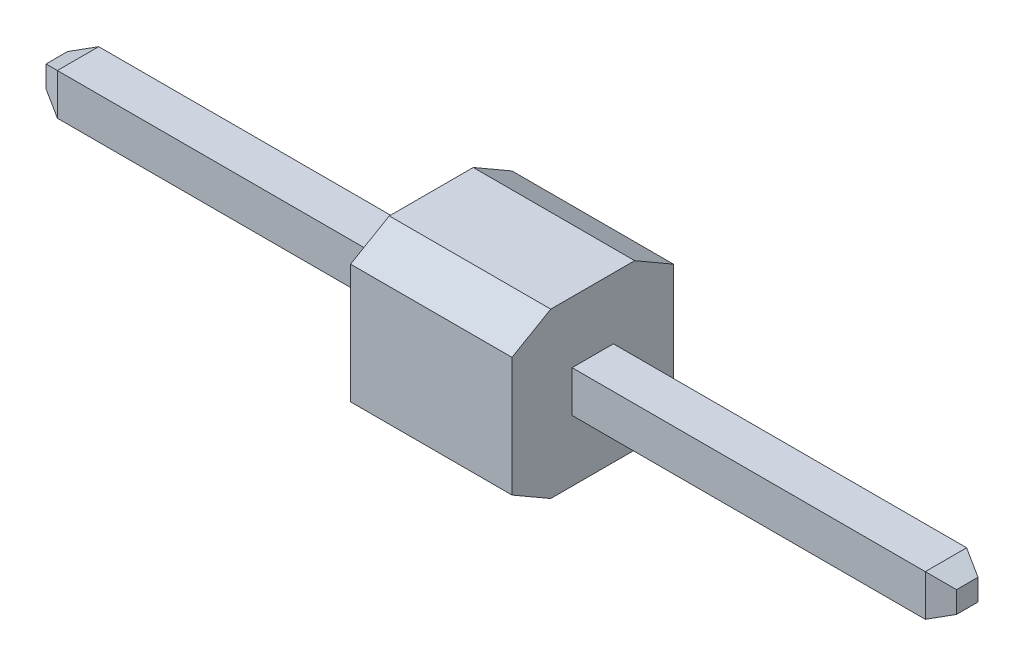
ISO-10303-21;
HEADER;
FILE_DESCRIPTION(('STEP AP214'),'2;1');
FILE_NAME('part.step','',(''),(''),'','','');
FILE_SCHEMA(('AUTOMOTIVE_DESIGN { 1 0 10303 214 1 1 1 1 }'));
ENDSEC;
DATA;
#1=APPLICATION_CONTEXT('core data for automotive mechanical design processes');
#2=APPLICATION_PROTOCOL_DEFINITION('international standard','automotive_design',2000,#1);
#3=PRODUCT_CONTEXT('',#1,'mechanical');
#4=PRODUCT('Part','Part','',(#3));
#5=PRODUCT_RELATED_PRODUCT_CATEGORY('part','',(#4));
#6=PRODUCT_DEFINITION_FORMATION('','',#4);
#7=PRODUCT_DEFINITION_CONTEXT('part definition',#1,'design');
#8=PRODUCT_DEFINITION('design','',#6,#7);
#9=PRODUCT_DEFINITION_SHAPE('','',#8);
#10=(LENGTH_UNIT() NAMED_UNIT(*) SI_UNIT(.MILLI.,.METRE.));
#11=(NAMED_UNIT(*) PLANE_ANGLE_UNIT() SI_UNIT($,.RADIAN.));
#12=(NAMED_UNIT(*) SI_UNIT($,.STERADIAN.) SOLID_ANGLE_UNIT());
#13=UNCERTAINTY_MEASURE_WITH_UNIT(LENGTH_MEASURE(1.E-05),#10,'distance_accuracy_value','');
#14=(GEOMETRIC_REPRESENTATION_CONTEXT(3) GLOBAL_UNCERTAINTY_ASSIGNED_CONTEXT((#13)) GLOBAL_UNIT_ASSIGNED_CONTEXT((#10,
#11,#12)) REPRESENTATION_CONTEXT('',''));
#15=CARTESIAN_POINT('',(0.,0.,0.));
#16=DIRECTION('',(0.,0.,1.));
#17=DIRECTION('',(1.,0.,0.));
#18=AXIS2_PLACEMENT_3D('',#15,#16,#17);
#19=CARTESIAN_POINT('',(5.42105110893747,2.85712144810304,-2.62999847646261));
#20=DIRECTION('',(1.,-9.93476518829084E-08,4.37113882867379E-08));
#21=DIRECTION('',(-9.93476589883358E-08,-1.,8.74227765734759E-08));
#22=AXIS2_PLACEMENT_3D('',#19,#20,#21);
#23=PLANE('',#22);
#24=DIRECTION('',(-1.18186632779335E-08,-0.50000007571054,-0.866025360072933));
#25=VECTOR('',#24,1.);
#26=CARTESIAN_POINT('',(5.42105091676287,1.61353174686681,-1.05999836774454));
#27=LINE('',#26,#25);
#28=CARTESIAN_POINT('',(5.42105091676287,1.61353174686681,-1.05999836774454));
#29=VERTEX_POINT('',#28);
#30=CARTESIAN_POINT('',(5.42105090857466,1.26712153290314,-1.6599983374604));
#31=VERTEX_POINT('',#30);
#32=EDGE_CURVE('E11',#29,#31,#27,.T.);
#33=ORIENTED_EDGE('',*,*,#32,.T.);
#34=DIRECTION('',(4.37113811813104E-08,-8.74227828590458E-08,-0.999999999999995));
#35=VECTOR('',#34,1.);
#36=CARTESIAN_POINT('',(5.42105090857466,1.26712153290314,-1.6599983374604));
#37=LINE('',#36,#35);
#38=CARTESIAN_POINT('',(5.42105096539945,1.26712141925352,-2.9599983374604));
#39=VERTEX_POINT('',#38);
#40=EDGE_CURVE('E304',#31,#39,#37,.T.);
#41=ORIENTED_EDGE('',*,*,#40,.T.);
#42=DIRECTION('',(8.75289963531795E-08,0.499999924289837,-0.866025447495713));
#43=VECTOR('',#42,1.);
#44=CARTESIAN_POINT('',(5.42105096539945,1.26712141925352,-2.9599983374604));
#45=LINE('',#44,#43);
#46=CARTESIAN_POINT('',(5.42105102604132,1.61353152830985,-3.55999836774454));
#47=VERTEX_POINT('',#46);
#48=EDGE_CURVE('E296',#39,#47,#45,.T.);
#49=ORIENTED_EDGE('',*,*,#48,.T.);
#50=DIRECTION('',(9.93476588436478E-08,0.999999999999991,-8.74227764822788E-08));
#51=VECTOR('',#50,1.);
#52=CARTESIAN_POINT('',(5.42105102604132,1.61353152830985,-3.55999836774454));
#53=LINE('',#52,#51);
#54=CARTESIAN_POINT('',(5.4210512095543,3.46071120527985,-3.55999852923011));
#55=VERTEX_POINT('',#54);
#56=EDGE_CURVE('E281',#47,#55,#53,.T.);
#57=ORIENTED_EDGE('',*,*,#56,.T.);
#58=DIRECTION('',(-1.18186619958731E-08,-0.500000075710537,-0.866025360072935));
#59=VECTOR('',#58,1.);
#60=CARTESIAN_POINT('',(5.42105121774251,3.80712141925352,-2.95999855951425));
#61=LINE('',#60,#59);
#62=CARTESIAN_POINT('',(5.42105121774251,3.80712141925352,-2.95999855951425));
#63=VERTEX_POINT('',#62);
#64=EDGE_CURVE('E265',#63,#55,#61,.T.);
#65=ORIENTED_EDGE('',*,*,#64,.F.);
#66=DIRECTION('',(4.37113811813104E-08,-8.74227814926175E-08,-0.999999999999995));
#67=VECTOR('',#66,1.);
#68=CARTESIAN_POINT('',(5.42105116091771,3.80712153290314,-1.65999855951425));
#69=LINE('',#68,#67);
#70=CARTESIAN_POINT('',(5.42105116091771,3.80712153290314,-1.65999855951425));
#71=VERTEX_POINT('',#70);
#72=EDGE_CURVE('E248',#71,#63,#69,.T.);
#73=ORIENTED_EDGE('',*,*,#72,.F.);
#74=DIRECTION('',(8.75289963525478E-08,0.499999924289836,-0.866025447495714));
#75=VECTOR('',#74,1.);
#76=CARTESIAN_POINT('',(5.42105110027584,3.46071142383681,-1.05999852923011));
#77=LINE('',#76,#75);
#78=CARTESIAN_POINT('',(5.42105110027584,3.46071142383681,-1.05999852923011));
#79=VERTEX_POINT('',#78);
#80=EDGE_CURVE('E242',#79,#71,#77,.T.);
#81=ORIENTED_EDGE('',*,*,#80,.F.);
#82=DIRECTION('',(9.93476588436478E-08,0.999999999999991,-8.74227763620714E-08));
#83=VECTOR('',#82,1.);
#84=CARTESIAN_POINT('',(5.42105091676287,1.61353174686681,-1.05999836774454));
#85=LINE('',#84,#83);
#86=EDGE_CURVE('E236',#29,#79,#85,.T.);
#87=ORIENTED_EDGE('',*,*,#86,.F.);
#88=EDGE_LOOP('',(#33,#41,#49,#57,#65,#73,#81,#87));
#89=FACE_BOUND('',#88,.T.);
#90=DIRECTION('',(-4.37113817364219E-08,8.74227801261891E-08,0.999999999999995));
#91=VECTOR('',#90,1.);
#92=CARTESIAN_POINT('',(5.42105104535497,2.21712144810304,-2.62999842051204));
#93=LINE('',#92,#91);
#94=CARTESIAN_POINT('',(5.42105104535497,2.21712144810304,-2.62999842051204));
#95=VERTEX_POINT('',#94);
#96=CARTESIAN_POINT('',(5.42105101737969,2.21712150405362,-1.98999842051204));
#97=VERTEX_POINT('',#96);
#98=EDGE_CURVE('E302',#95,#97,#93,.T.);
#99=ORIENTED_EDGE('',*,*,#98,.T.);
#100=DIRECTION('',(-9.93476592658908E-08,-0.999999999999991,8.74227763097973E-08));
#101=VECTOR('',#100,1.);
#102=CARTESIAN_POINT('',(5.42105108096219,2.85712150405362,-1.98999847646261));
#103=LINE('',#102,#101);
#104=CARTESIAN_POINT('',(5.42105108096219,2.85712150405362,-1.98999847646261));
#105=VERTEX_POINT('',#104);
#106=EDGE_CURVE('E293',#105,#97,#103,.T.);
#107=ORIENTED_EDGE('',*,*,#106,.F.);
#108=DIRECTION('',(-4.37113817364219E-08,8.74227829017466E-08,0.999999999999995));
#109=VECTOR('',#108,1.);
#110=CARTESIAN_POINT('',(5.42105110893747,2.85712144810304,-2.62999847646261));
#111=LINE('',#110,#109);
#112=CARTESIAN_POINT('',(5.42105110893747,2.85712144810304,-2.62999847646261));
#113=VERTEX_POINT('',#112);
#114=EDGE_CURVE('E278',#113,#105,#111,.T.);
#115=ORIENTED_EDGE('',*,*,#114,.F.);
#116=DIRECTION('',(-9.93476592658908E-08,-0.999999999999991,8.7422776656742E-08));
#117=VECTOR('',#116,1.);
#118=CARTESIAN_POINT('',(5.42105110893747,2.85712144810304,-2.62999847646261));
#119=LINE('',#118,#117);
#120=EDGE_CURVE('E263',#113,#95,#119,.T.);
#121=ORIENTED_EDGE('',*,*,#120,.T.);
#122=EDGE_LOOP('',(#99,#107,#115,#121));
#123=FACE_BOUND('',#122,.T.);
#124=ADVANCED_FACE('F17',(#89,#123),#23,.T.);
#125=CARTESIAN_POINT('',(2.92105110893747,2.85712169647217,-2.62999858574108));
#126=DIRECTION('',(1.,-9.93476518829084E-08,4.37113882867379E-08));
#127=DIRECTION('',(-9.93476589883358E-08,-1.,8.74227765734759E-08));
#128=AXIS2_PLACEMENT_3D('',#125,#126,#127);
#129=PLANE('',#128);
#130=DIRECTION('',(-1.18186632779335E-08,-0.50000007571054,-0.866025360072933));
#131=VECTOR('',#130,1.);
#132=CARTESIAN_POINT('',(2.92105091676287,1.61353199523594,-1.05999847702301));
#133=LINE('',#132,#131);
#134=CARTESIAN_POINT('',(2.92105091676287,1.61353199523594,-1.05999847702301));
#135=VERTEX_POINT('',#134);
#136=CARTESIAN_POINT('',(2.92105090857466,1.26712178127227,-1.65999844673887));
#137=VERTEX_POINT('',#136);
#138=EDGE_CURVE('E24',#135,#137,#133,.T.);
#139=ORIENTED_EDGE('',*,*,#138,.F.);
#140=DIRECTION('',(9.93476588436478E-08,0.999999999999991,-8.74227763620714E-08));
#141=VECTOR('',#140,1.);
#142=CARTESIAN_POINT('',(2.92105091676287,1.61353199523594,-1.05999847702301));
#143=LINE('',#142,#141);
#144=CARTESIAN_POINT('',(2.92105110027584,3.46071167220594,-1.05999863850858));
#145=VERTEX_POINT('',#144);
#146=EDGE_CURVE('E300',#135,#145,#143,.T.);
#147=ORIENTED_EDGE('',*,*,#146,.T.);
#148=DIRECTION('',(8.75289963525478E-08,0.499999924289836,-0.866025447495714));
#149=VECTOR('',#148,1.);
#150=CARTESIAN_POINT('',(2.92105110027584,3.46071167220594,-1.05999863850858));
#151=LINE('',#150,#149);
#152=CARTESIAN_POINT('',(2.92105116091771,3.80712178127227,-1.65999866879272));
#153=VERTEX_POINT('',#152);
#154=EDGE_CURVE('E286',#145,#153,#151,.T.);
#155=ORIENTED_EDGE('',*,*,#154,.T.);
#156=DIRECTION('',(4.37113811813104E-08,-8.74227814926175E-08,-0.999999999999995));
#157=VECTOR('',#156,1.);
#158=CARTESIAN_POINT('',(2.92105116091771,3.80712178127227,-1.65999866879272));
#159=LINE('',#158,#157);
#160=CARTESIAN_POINT('',(2.92105121774251,3.80712166762265,-2.95999866879272));
#161=VERTEX_POINT('',#160);
#162=EDGE_CURVE('E271',#153,#161,#159,.T.);
#163=ORIENTED_EDGE('',*,*,#162,.T.);
#164=DIRECTION('',(-1.18186626368607E-08,-0.500000075710537,-0.866025360072935));
#165=VECTOR('',#164,1.);
#166=CARTESIAN_POINT('',(2.92105121774251,3.80712166762265,-2.95999866879272));
#167=LINE('',#166,#165);
#168=CARTESIAN_POINT('',(2.92105120955429,3.46071145364898,-3.55999863850858));
#169=VERTEX_POINT('',#168);
#170=EDGE_CURVE('E253',#161,#169,#167,.T.);
#171=ORIENTED_EDGE('',*,*,#170,.T.);
#172=DIRECTION('',(9.93476588436478E-08,0.999999999999991,-8.74227764822788E-08));
#173=VECTOR('',#172,1.);
#174=CARTESIAN_POINT('',(2.92105102604132,1.61353177667898,-3.55999847702301));
#175=LINE('',#174,#173);
#176=CARTESIAN_POINT('',(2.92105102604132,1.61353177667898,-3.55999847702301));
#177=VERTEX_POINT('',#176);
#178=EDGE_CURVE('E261',#177,#169,#175,.T.);
#179=ORIENTED_EDGE('',*,*,#178,.F.);
#180=DIRECTION('',(8.75289963531795E-08,0.499999924289837,-0.866025447495713));
#181=VECTOR('',#180,1.);
#182=CARTESIAN_POINT('',(2.92105096539945,1.26712166762265,-2.95999844673887));
#183=LINE('',#182,#181);
#184=CARTESIAN_POINT('',(2.92105096539945,1.26712166762265,-2.95999844673887));
#185=VERTEX_POINT('',#184);
#186=EDGE_CURVE('E276',#185,#177,#183,.T.);
#187=ORIENTED_EDGE('',*,*,#186,.F.);
#188=DIRECTION('',(4.37113811813104E-08,-8.74227828590458E-08,-0.999999999999995));
#189=VECTOR('',#188,1.);
#190=CARTESIAN_POINT('',(2.92105090857466,1.26712178127227,-1.65999844673887));
#191=LINE('',#190,#189);
#192=EDGE_CURVE('E291',#137,#185,#191,.T.);
#193=ORIENTED_EDGE('',*,*,#192,.F.);
#194=EDGE_LOOP('',(#139,#147,#155,#163,#171,#179,#187,#193));
#195=FACE_BOUND('',#194,.T.);
#196=DIRECTION('',(-9.93476585720014E-08,-0.999999999999991,8.74227763097973E-08));
#197=VECTOR('',#196,1.);
#198=CARTESIAN_POINT('',(2.92105108096219,2.85712175242275,-1.98999858574108));
#199=LINE('',#198,#197);
#200=CARTESIAN_POINT('',(2.92105108096219,2.85712175242275,-1.98999858574108));
#201=VERTEX_POINT('',#200);
#202=CARTESIAN_POINT('',(2.92105101737969,2.21712175242275,-1.98999852979051));
#203=VERTEX_POINT('',#202);
#204=EDGE_CURVE('E298',#201,#203,#199,.T.);
#205=ORIENTED_EDGE('',*,*,#204,.T.);
#206=DIRECTION('',(-4.37113810425325E-08,8.74227801261891E-08,0.999999999999995));
#207=VECTOR('',#206,1.);
#208=CARTESIAN_POINT('',(2.92105104535497,2.21712169647217,-2.62999852979051));
#209=LINE('',#208,#207);
#210=CARTESIAN_POINT('',(2.92105104535497,2.21712169647217,-2.62999852979051));
#211=VERTEX_POINT('',#210);
#212=EDGE_CURVE('E283',#211,#203,#209,.T.);
#213=ORIENTED_EDGE('',*,*,#212,.F.);
#214=DIRECTION('',(-9.93476592658908E-08,-0.999999999999991,8.7422776656742E-08));
#215=VECTOR('',#214,1.);
#216=CARTESIAN_POINT('',(2.92105110893747,2.85712169647217,-2.62999858574108));
#217=LINE('',#216,#215);
#218=CARTESIAN_POINT('',(2.92105110893747,2.85712169647217,-2.62999858574108));
#219=VERTEX_POINT('',#218);
#220=EDGE_CURVE('E268',#219,#211,#217,.T.);
#221=ORIENTED_EDGE('',*,*,#220,.F.);
#222=DIRECTION('',(-4.37113817364219E-08,8.74227829017466E-08,0.999999999999995));
#223=VECTOR('',#222,1.);
#224=CARTESIAN_POINT('',(2.92105110893747,2.85712169647217,-2.62999858574108));
#225=LINE('',#224,#223);
#226=EDGE_CURVE('E251',#219,#201,#225,.T.);
#227=ORIENTED_EDGE('',*,*,#226,.T.);
#228=EDGE_LOOP('',(#205,#213,#221,#227));
#229=FACE_BOUND('',#228,.T.);
#230=ADVANCED_FACE('F314',(#195,#229),#129,.F.);
#231=CARTESIAN_POINT('',(5.42105091676287,1.61353174686681,-1.05999836774454));
#232=DIRECTION('',(1.07893287081065E-07,0.866025360072937,-0.500000075710535));
#233=DIRECTION('',(1.18186629566715E-08,0.500000075710542,0.866025360072941));
#234=AXIS2_PLACEMENT_3D('',#231,#232,#233);
#235=PLANE('',#234);
#236=ORIENTED_EDGE('',*,*,#138,.T.);
#237=DIRECTION('',(-0.999999999999994,9.93476511723651E-08,-4.37113884643734E-08));
#238=VECTOR('',#237,1.);
#239=CARTESIAN_POINT('',(5.42105090857466,1.26712153290314,-1.6599983374604));
#240=LINE('',#239,#238);
#241=EDGE_CURVE('E288',#31,#137,#240,.T.);
#242=ORIENTED_EDGE('',*,*,#241,.F.);
#243=ORIENTED_EDGE('',*,*,#32,.F.);
#244=DIRECTION('',(-0.999999999999994,9.93476518829078E-08,-4.3711388109102E-08));
#245=VECTOR('',#244,1.);
#246=CARTESIAN_POINT('',(5.42105091676287,1.61353174686681,-1.05999836774454));
#247=LINE('',#246,#245);
#248=EDGE_CURVE('E256',#29,#135,#247,.T.);
#249=ORIENTED_EDGE('',*,*,#248,.T.);
#250=EDGE_LOOP('',(#236,#242,#243,#249));
#251=FACE_BOUND('',#250,.T.);
#252=ADVANCED_FACE('F306',(#251),#235,.F.);
#253=CARTESIAN_POINT('',(5.42105090857466,1.26712153290314,-1.6599983374604));
#254=DIRECTION('',(9.93476589883358E-08,1.,-8.74227765734759E-08));
#255=DIRECTION('',(1.,-9.93476518829084E-08,4.37113882867379E-08));
#256=AXIS2_PLACEMENT_3D('',#253,#254,#255);
#257=PLANE('',#256);
#258=ORIENTED_EDGE('',*,*,#192,.T.);
#259=DIRECTION('',(-0.999999999999994,9.93476511723651E-08,-4.37113882867377E-08));
#260=VECTOR('',#259,1.);
#261=CARTESIAN_POINT('',(5.42105096539945,1.26712141925352,-2.9599983374604));
#262=LINE('',#261,#260);
#263=EDGE_CURVE('E273',#39,#185,#262,.T.);
#264=ORIENTED_EDGE('',*,*,#263,.F.);
#265=ORIENTED_EDGE('',*,*,#40,.F.);
#266=ORIENTED_EDGE('',*,*,#241,.T.);
#267=EDGE_LOOP('',(#258,#264,#265,#266));
#268=FACE_BOUND('',#267,.T.);
#269=ADVANCED_FACE('F311',(#268),#257,.F.);
#270=CARTESIAN_POINT('',(5.42105096539945,1.26712141925352,-2.9599983374604));
#271=DIRECTION('',(6.41819058997377E-08,0.866025447495721,0.499999924289845));
#272=DIRECTION('',(-8.7528996031702E-08,-0.499999924289838,0.866025447495717));
#273=AXIS2_PLACEMENT_3D('',#270,#271,#272);
#274=PLANE('',#273);
#275=ORIENTED_EDGE('',*,*,#186,.T.);
#276=DIRECTION('',(-0.999999999999994,9.93476518829078E-08,-4.37113882867377E-08));
#277=VECTOR('',#276,1.);
#278=CARTESIAN_POINT('',(5.42105102604132,1.61353152830985,-3.55999836774454));
#279=LINE('',#278,#277);
#280=EDGE_CURVE('E258',#47,#177,#279,.T.);
#281=ORIENTED_EDGE('',*,*,#280,.F.);
#282=ORIENTED_EDGE('',*,*,#48,.F.);
#283=ORIENTED_EDGE('',*,*,#263,.T.);
#284=EDGE_LOOP('',(#275,#281,#282,#283));
#285=FACE_BOUND('',#284,.T.);
#286=ADVANCED_FACE('F319',(#285),#274,.F.);
#287=CARTESIAN_POINT('',(5.42105102604132,1.61353152830985,-3.55999836774454));
#288=DIRECTION('',(-4.37113811813106E-08,8.74227836789032E-08,1.));
#289=DIRECTION('',(-1.,9.93476518829084E-08,-4.37113882867379E-08));
#290=AXIS2_PLACEMENT_3D('',#287,#288,#289);
#291=PLANE('',#290);
#292=ORIENTED_EDGE('',*,*,#178,.T.);
#293=DIRECTION('',(-0.999999999999994,9.93476518829078E-08,-4.37113884643734E-08));
#294=VECTOR('',#293,1.);
#295=CARTESIAN_POINT('',(5.4210512095543,3.46071120527985,-3.55999852923011));
#296=LINE('',#295,#294);
#297=EDGE_CURVE('E245',#55,#169,#296,.T.);
#298=ORIENTED_EDGE('',*,*,#297,.F.);
#299=ORIENTED_EDGE('',*,*,#56,.F.);
#300=ORIENTED_EDGE('',*,*,#280,.T.);
#301=EDGE_LOOP('',(#292,#298,#299,#300));
#302=FACE_BOUND('',#301,.T.);
#303=ADVANCED_FACE('F326',(#302),#291,.F.);
#304=CARTESIAN_POINT('',(5.42105121774251,3.80712141925352,-2.95999855951425));
#305=DIRECTION('',(1.07893287081065E-07,0.866025360072937,-0.500000075710535));
#306=DIRECTION('',(1.18186629566715E-08,0.500000075710542,0.866025360072941));
#307=AXIS2_PLACEMENT_3D('',#304,#305,#306);
#308=PLANE('',#307);
#309=ORIENTED_EDGE('',*,*,#170,.F.);
#310=DIRECTION('',(-0.999999999999994,9.93476504618223E-08,-4.37113882867377E-08));
#311=VECTOR('',#310,1.);
#312=CARTESIAN_POINT('',(5.42105121774251,3.80712141925352,-2.95999855951425));
#313=LINE('',#312,#311);
#314=EDGE_CURVE('E239',#63,#161,#313,.T.);
#315=ORIENTED_EDGE('',*,*,#314,.F.);
#316=ORIENTED_EDGE('',*,*,#64,.T.);
#317=ORIENTED_EDGE('',*,*,#297,.T.);
#318=EDGE_LOOP('',(#309,#315,#316,#317));
#319=FACE_BOUND('',#318,.T.);
#320=ADVANCED_FACE('F329',(#319),#308,.T.);
#321=CARTESIAN_POINT('',(5.42105116091771,3.80712153290314,-1.65999855951425));
#322=DIRECTION('',(9.93476589883358E-08,1.,-8.74227765734759E-08));
#323=DIRECTION('',(1.,-9.93476518829084E-08,4.37113882867379E-08));
#324=AXIS2_PLACEMENT_3D('',#321,#322,#323);
#325=PLANE('',#324);
#326=ORIENTED_EDGE('',*,*,#162,.F.);
#327=DIRECTION('',(-0.999999999999994,9.93476504618223E-08,-4.37113883755555E-08));
#328=VECTOR('',#327,1.);
#329=CARTESIAN_POINT('',(5.42105116091771,3.80712153290314,-1.65999855951425));
#330=LINE('',#329,#328);
#331=EDGE_CURVE('E233',#71,#153,#330,.T.);
#332=ORIENTED_EDGE('',*,*,#331,.F.);
#333=ORIENTED_EDGE('',*,*,#72,.T.);
#334=ORIENTED_EDGE('',*,*,#314,.T.);
#335=EDGE_LOOP('',(#326,#332,#333,#334));
#336=FACE_BOUND('',#335,.T.);
#337=ADVANCED_FACE('F333',(#336),#325,.T.);
#338=CARTESIAN_POINT('',(5.42105110027584,3.46071142383681,-1.05999852923011));
#339=DIRECTION('',(6.41819058997377E-08,0.866025447495721,0.499999924289845));
#340=DIRECTION('',(-8.7528996031702E-08,-0.499999924289838,0.866025447495717));
#341=AXIS2_PLACEMENT_3D('',#338,#339,#340);
#342=PLANE('',#341);
#343=ORIENTED_EDGE('',*,*,#154,.F.);
#344=DIRECTION('',(-0.999999999999994,9.93476518829078E-08,-4.3711388109102E-08));
#345=VECTOR('',#344,1.);
#346=CARTESIAN_POINT('',(5.42105110027584,3.46071142383681,-1.05999852923011));
#347=LINE('',#346,#345);
#348=EDGE_CURVE('E230',#79,#145,#347,.T.);
#349=ORIENTED_EDGE('',*,*,#348,.F.);
#350=ORIENTED_EDGE('',*,*,#80,.T.);
#351=ORIENTED_EDGE('',*,*,#331,.T.);
#352=EDGE_LOOP('',(#343,#349,#350,#351));
#353=FACE_BOUND('',#352,.T.);
#354=ADVANCED_FACE('F337',(#353),#342,.T.);
#355=CARTESIAN_POINT('',(5.42105091676287,1.61353174686681,-1.05999836774454));
#356=DIRECTION('',(-4.37113811813106E-08,8.74227835615132E-08,1.));
#357=DIRECTION('',(-9.93476589883358E-08,-1.,8.74227764560859E-08));
#358=AXIS2_PLACEMENT_3D('',#355,#356,#357);
#359=PLANE('',#358);
#360=ORIENTED_EDGE('',*,*,#146,.F.);
#361=ORIENTED_EDGE('',*,*,#248,.F.);
#362=ORIENTED_EDGE('',*,*,#86,.T.);
#363=ORIENTED_EDGE('',*,*,#348,.T.);
#364=EDGE_LOOP('',(#360,#361,#362,#363));
#365=FACE_BOUND('',#364,.T.);
#366=ADVANCED_FACE('F339',(#365),#359,.T.);
#367=CARTESIAN_POINT('',(-2.87894889106253,2.85712227268855,-2.62999883926714));
#368=DIRECTION('',(-1.,9.93476518829084E-08,-4.37113882867379E-08));
#369=DIRECTION('',(9.93476589883358E-08,1.,-8.74227765734759E-08));
#370=AXIS2_PLACEMENT_3D('',#367,#368,#369);
#371=PLANE('',#370);
#372=DIRECTION('',(9.93476554744631E-08,0.999999999999991,-8.74227761415115E-08));
#373=VECTOR('',#372,1.);
#374=CARTESIAN_POINT('',(-2.87894896060617,2.37100384237638,-2.14388032396031));
#375=LINE('',#374,#373);
#376=CARTESIAN_POINT('',(-2.87894896060617,2.37100384237638,-2.14388032396031));
#377=VERTEX_POINT('',#376);
#378=CARTESIAN_POINT('',(-2.87894892759921,2.70324078798638,-2.14388035300539));
#379=VERTEX_POINT('',#378);
#380=EDGE_CURVE('E228',#377,#379,#375,.T.);
#381=ORIENTED_EDGE('',*,*,#380,.T.);
#382=DIRECTION('',(4.37113820547149E-08,-8.74227694560864E-08,-0.999999999999995));
#383=VECTOR('',#382,1.);
#384=CARTESIAN_POINT('',(-2.87894892759921,2.70324078798638,-2.14388035300539));
#385=LINE('',#384,#383);
#386=CARTESIAN_POINT('',(-2.87894891307667,2.7032407589413,-2.47611729862339));
#387=VERTEX_POINT('',#386);
#388=EDGE_CURVE('E223',#379,#387,#385,.T.);
#389=ORIENTED_EDGE('',*,*,#388,.T.);
#390=DIRECTION('',(-9.93476634944484E-08,-0.999999999999991,8.7422776141512E-08));
#391=VECTOR('',#390,1.);
#392=CARTESIAN_POINT('',(-2.87894891307667,2.7032407589413,-2.47611729862339));
#393=LINE('',#392,#391);
#394=CARTESIAN_POINT('',(-2.87894894608363,2.3710038133313,-2.47611726957831));
#395=VERTEX_POINT('',#394);
#396=EDGE_CURVE('E215',#387,#395,#393,.T.);
#397=ORIENTED_EDGE('',*,*,#396,.T.);
#398=DIRECTION('',(-4.37113740347301E-08,8.74227801493995E-08,0.999999999999995));
#399=VECTOR('',#398,1.);
#400=CARTESIAN_POINT('',(-2.87894894608363,2.3710038133313,-2.47611726957831));
#401=LINE('',#400,#399);
#402=EDGE_CURVE('E207',#395,#377,#401,.T.);
#403=ORIENTED_EDGE('',*,*,#402,.T.);
#404=EDGE_LOOP('',(#381,#389,#397,#403));
#405=FACE_BOUND('',#404,.T.);
#406=ADVANCED_FACE('F341',(#405),#371,.T.);
#407=CARTESIAN_POINT('',(-2.87894889106253,2.85712227268855,-2.62999883926714));
#408=DIRECTION('',(9.93476589883358E-08,1.,-8.74227764510112E-08));
#409=DIRECTION('',(-4.37113811813106E-08,8.74227835564385E-08,1.));
#410=AXIS2_PLACEMENT_3D('',#407,#408,#409);
#411=PLANE('',#410);
#412=DIRECTION('',(0.999999999999994,-9.93476527532252E-08,4.37113882769953E-08));
#413=VECTOR('',#412,1.);
#414=CARTESIAN_POINT('',(-2.54894889106253,2.85712223990382,-2.62999882484238));
#415=LINE('',#414,#413);
#416=CARTESIAN_POINT('',(-2.54894889106253,2.85712223990382,-2.62999882484238));
#417=VERTEX_POINT('',#416);
#418=EDGE_CURVE('E225',#417,#219,#415,.T.);
#419=ORIENTED_EDGE('',*,*,#418,.F.);
#420=DIRECTION('',(-4.37113817364219E-08,8.74227829017466E-08,0.999999999999995));
#421=VECTOR('',#420,1.);
#422=CARTESIAN_POINT('',(-2.54894889106253,2.85712223990382,-2.62999882484238));
#423=LINE('',#422,#421);
#424=CARTESIAN_POINT('',(-2.54894891903781,2.8571222958544,-1.98999882484238));
#425=VERTEX_POINT('',#424);
#426=EDGE_CURVE('E217',#417,#425,#423,.T.);
#427=ORIENTED_EDGE('',*,*,#426,.T.);
#428=DIRECTION('',(0.999999999999994,-9.93476527532252E-08,4.3711388195809E-08));
#429=VECTOR('',#428,1.);
#430=CARTESIAN_POINT('',(-2.54894891903781,2.8571222958544,-1.98999882484238));
#431=LINE('',#430,#429);
#432=EDGE_CURVE('E220',#425,#201,#431,.T.);
#433=ORIENTED_EDGE('',*,*,#432,.T.);
#434=ORIENTED_EDGE('',*,*,#226,.F.);
#435=EDGE_LOOP('',(#419,#427,#433,#434));
#436=FACE_BOUND('',#435,.T.);
#437=ADVANCED_FACE('F348',(#436),#411,.T.);
#438=CARTESIAN_POINT('',(-2.87894891903781,2.85712232863913,-1.98999883926714));
#439=DIRECTION('',(-4.37113811813106E-08,8.74227836789032E-08,1.));
#440=DIRECTION('',(-1.,9.93476518829084E-08,-4.37113882867379E-08));
#441=AXIS2_PLACEMENT_3D('',#438,#439,#440);
#442=PLANE('',#441);
#443=ORIENTED_EDGE('',*,*,#432,.F.);
#444=DIRECTION('',(-9.93476592658908E-08,-0.999999999999991,8.74227763097973E-08));
#445=VECTOR('',#444,1.);
#446=CARTESIAN_POINT('',(-2.54894891903781,2.8571222958544,-1.98999882484238));
#447=LINE('',#446,#445);
#448=CARTESIAN_POINT('',(-2.54894898262031,2.2171222958544,-1.9899987688918));
#449=VERTEX_POINT('',#448);
#450=EDGE_CURVE('E209',#425,#449,#447,.T.);
#451=ORIENTED_EDGE('',*,*,#450,.T.);
#452=DIRECTION('',(0.999999999999994,-9.93476524284799E-08,4.37113882364021E-08));
#453=VECTOR('',#452,1.);
#454=CARTESIAN_POINT('',(-2.54894898262031,2.2171222958544,-1.9899987688918));
#455=LINE('',#454,#453);
#456=EDGE_CURVE('E212',#449,#203,#455,.T.);
#457=ORIENTED_EDGE('',*,*,#456,.T.);
#458=ORIENTED_EDGE('',*,*,#204,.F.);
#459=EDGE_LOOP('',(#443,#451,#457,#458));
#460=FACE_BOUND('',#459,.T.);
#461=ADVANCED_FACE('F424',(#460),#442,.T.);
#462=CARTESIAN_POINT('',(-2.87894895464503,2.21712227268855,-2.62999878331656));
#463=DIRECTION('',(9.93476589883357E-08,1.,-8.74227764040693E-08));
#464=DIRECTION('',(-4.37113811813106E-08,8.74227835094966E-08,1.));
#465=AXIS2_PLACEMENT_3D('',#462,#463,#464);
#466=PLANE('',#465);
#467=ORIENTED_EDGE('',*,*,#456,.F.);
#468=DIRECTION('',(4.37113831242007E-08,-8.74227884528618E-08,-0.999999999999995));
#469=VECTOR('',#468,1.);
#470=CARTESIAN_POINT('',(-2.54894898262031,2.21712229585441,-1.9899987688918));
#471=LINE('',#470,#469);
#472=CARTESIAN_POINT('',(-2.54894895464503,2.21712223990382,-2.6299987688918));
#473=VERTEX_POINT('',#472);
#474=EDGE_CURVE('E201',#449,#473,#471,.T.);
#475=ORIENTED_EDGE('',*,*,#474,.T.);
#476=DIRECTION('',(0.999999999999994,-9.93476524284799E-08,4.37113882769953E-08));
#477=VECTOR('',#476,1.);
#478=CARTESIAN_POINT('',(-2.54894895464503,2.21712223990382,-2.6299987688918));
#479=LINE('',#478,#477);
#480=EDGE_CURVE('E204',#473,#211,#479,.T.);
#481=ORIENTED_EDGE('',*,*,#480,.T.);
#482=ORIENTED_EDGE('',*,*,#212,.T.);
#483=EDGE_LOOP('',(#467,#475,#481,#482));
#484=FACE_BOUND('',#483,.T.);
#485=ADVANCED_FACE('F421',(#484),#466,.F.);
#486=CARTESIAN_POINT('',(-2.87894889106253,2.85712227268855,-2.62999883926714));
#487=DIRECTION('',(-4.37113811813106E-08,8.74227836789032E-08,1.));
#488=DIRECTION('',(-1.,9.93476518829084E-08,-4.37113882867379E-08));
#489=AXIS2_PLACEMENT_3D('',#486,#487,#488);
#490=PLANE('',#489);
#491=ORIENTED_EDGE('',*,*,#480,.F.);
#492=DIRECTION('',(9.93476606536696E-08,0.999999999999991,-8.7422776656742E-08));
#493=VECTOR('',#492,1.);
#494=CARTESIAN_POINT('',(-2.54894895464503,2.21712223990382,-2.6299987688918));
#495=LINE('',#494,#493);
#496=EDGE_CURVE('E196',#473,#417,#495,.T.);
#497=ORIENTED_EDGE('',*,*,#496,.T.);
#498=ORIENTED_EDGE('',*,*,#418,.T.);
#499=ORIENTED_EDGE('',*,*,#220,.T.);
#500=EDGE_LOOP('',(#491,#497,#498,#499));
#501=FACE_BOUND('',#500,.T.);
#502=ADVANCED_FACE('F376',(#501),#490,.F.);
#503=CARTESIAN_POINT('',(-2.87894889106253,2.85712227268855,-2.62999883926714));
#504=DIRECTION('',(-4.37113811813106E-08,8.74227836789032E-08,1.));
#505=DIRECTION('',(-1.,9.93476518829084E-08,-4.37113882867379E-08));
#506=AXIS2_PLACEMENT_3D('',#503,#504,#505);
#507=PLANE('',#506);
#508=DIRECTION('',(0.999999999999994,-9.93476569749143E-08,4.37113882769953E-08));
#509=VECTOR('',#508,1.);
#510=CARTESIAN_POINT('',(5.42105110893747,2.85712144810305,-2.62999847646261));
#511=LINE('',#510,#509);
#512=CARTESIAN_POINT('',(10.8910511089375,2.85712090467138,-2.62999823736132));
#513=VERTEX_POINT('',#512);
#514=EDGE_CURVE('E199',#113,#513,#511,.T.);
#515=ORIENTED_EDGE('',*,*,#514,.T.);
#516=DIRECTION('',(-9.93476606536696E-08,-0.999999999999991,8.7422776656742E-08));
#517=VECTOR('',#516,1.);
#518=CARTESIAN_POINT('',(10.8910511089375,2.85712090467138,-2.62999823736132));
#519=LINE('',#518,#517);
#520=CARTESIAN_POINT('',(10.891051045355,2.21712090467138,-2.62999818141074));
#521=VERTEX_POINT('',#520);
#522=EDGE_CURVE('E191',#513,#521,#519,.T.);
#523=ORIENTED_EDGE('',*,*,#522,.T.);
#524=DIRECTION('',(0.999999999999994,-9.93476465830644E-08,4.37113882769953E-08));
#525=VECTOR('',#524,1.);
#526=CARTESIAN_POINT('',(5.42105104535497,2.21712144810303,-2.62999842051204));
#527=LINE('',#526,#525);
#528=EDGE_CURVE('E194',#95,#521,#527,.T.);
#529=ORIENTED_EDGE('',*,*,#528,.F.);
#530=ORIENTED_EDGE('',*,*,#120,.F.);
#531=EDGE_LOOP('',(#515,#523,#529,#530));
#532=FACE_BOUND('',#531,.T.);
#533=ADVANCED_FACE('F367',(#532),#507,.F.);
#534=CARTESIAN_POINT('',(-2.87894895464503,2.21712227268855,-2.62999878331656));
#535=DIRECTION('',(9.93476589883357E-08,1.,-8.74227764040693E-08));
#536=DIRECTION('',(-4.37113811813106E-08,8.74227835094966E-08,1.));
#537=AXIS2_PLACEMENT_3D('',#534,#535,#536);
#538=PLANE('',#537);
#539=ORIENTED_EDGE('',*,*,#528,.T.);
#540=DIRECTION('',(-4.37113817364219E-08,8.74227801261891E-08,0.999999999999995));
#541=VECTOR('',#540,1.);
#542=CARTESIAN_POINT('',(10.891051045355,2.21712090467138,-2.62999818141074));
#543=LINE('',#542,#541);
#544=CARTESIAN_POINT('',(10.8910510173797,2.21712096062196,-1.98999818141074));
#545=VERTEX_POINT('',#544);
#546=EDGE_CURVE('E186',#521,#545,#543,.T.);
#547=ORIENTED_EDGE('',*,*,#546,.T.);
#548=DIRECTION('',(0.999999999999994,-9.93476465830644E-08,4.37113881146227E-08));
#549=VECTOR('',#548,1.);
#550=CARTESIAN_POINT('',(5.42105101737969,2.21712150405361,-1.98999842051204));
#551=LINE('',#550,#549);
#552=EDGE_CURVE('E189',#97,#545,#551,.T.);
#553=ORIENTED_EDGE('',*,*,#552,.F.);
#554=ORIENTED_EDGE('',*,*,#98,.F.);
#555=EDGE_LOOP('',(#539,#547,#553,#554));
#556=FACE_BOUND('',#555,.T.);
#557=ADVANCED_FACE('F364',(#556),#538,.F.);
#558=CARTESIAN_POINT('',(-2.87894891903781,2.85712232863913,-1.98999883926714));
#559=DIRECTION('',(-4.37113811813106E-08,8.74227836789032E-08,1.));
#560=DIRECTION('',(-1.,9.93476518829084E-08,-4.37113882867379E-08));
#561=AXIS2_PLACEMENT_3D('',#558,#559,#560);
#562=PLANE('',#561);
#563=ORIENTED_EDGE('',*,*,#552,.T.);
#564=DIRECTION('',(9.93476578781121E-08,0.999999999999991,-8.74227759628526E-08));
#565=VECTOR('',#564,1.);
#566=CARTESIAN_POINT('',(10.8910510173797,2.21712096062197,-1.98999818141074));
#567=LINE('',#566,#565);
#568=CARTESIAN_POINT('',(10.8910510809622,2.85712096062196,-1.98999823736132));
#569=VERTEX_POINT('',#568);
#570=EDGE_CURVE('E176',#545,#569,#567,.T.);
#571=ORIENTED_EDGE('',*,*,#570,.T.);
#572=DIRECTION('',(0.999999999999994,-9.93476569749143E-08,4.37113881146227E-08));
#573=VECTOR('',#572,1.);
#574=CARTESIAN_POINT('',(5.42105108096219,2.85712150405363,-1.98999847646261));
#575=LINE('',#574,#573);
#576=EDGE_CURVE('E179',#105,#569,#575,.T.);
#577=ORIENTED_EDGE('',*,*,#576,.F.);
#578=ORIENTED_EDGE('',*,*,#106,.T.);
#579=EDGE_LOOP('',(#563,#571,#577,#578));
#580=FACE_BOUND('',#579,.T.);
#581=ADVANCED_FACE('F366',(#580),#562,.T.);
#582=CARTESIAN_POINT('',(-2.87894889106253,2.85712227268855,-2.62999883926714));
#583=DIRECTION('',(9.93476589883358E-08,1.,-8.74227764510112E-08));
#584=DIRECTION('',(-4.37113811813106E-08,8.74227835564385E-08,1.));
#585=AXIS2_PLACEMENT_3D('',#582,#583,#584);
#586=PLANE('',#585);
#587=ORIENTED_EDGE('',*,*,#576,.T.);
#588=DIRECTION('',(4.37113817364219E-08,-8.74227829017466E-08,-0.999999999999995));
#589=VECTOR('',#588,1.);
#590=CARTESIAN_POINT('',(10.8910510809622,2.85712096062196,-1.98999823736132));
#591=LINE('',#590,#589);
#592=EDGE_CURVE('E167',#569,#513,#591,.T.);
#593=ORIENTED_EDGE('',*,*,#592,.T.);
#594=ORIENTED_EDGE('',*,*,#514,.F.);
#595=ORIENTED_EDGE('',*,*,#114,.T.);
#596=EDGE_LOOP('',(#587,#593,#594,#595));
#597=FACE_BOUND('',#596,.T.);
#598=ADVANCED_FACE('F373',(#597),#586,.T.);
#599=CARTESIAN_POINT('',(11.2210511089375,2.85712087188666,-2.62999822293656));
#600=DIRECTION('',(-1.,9.93476518829084E-08,-4.37113882867379E-08));
#601=DIRECTION('',(9.93476589883358E-08,1.,-8.74227765734759E-08));
#602=AXIS2_PLACEMENT_3D('',#599,#600,#601);
#603=PLANE('',#602);
#604=DIRECTION('',(-9.93476581477919E-08,-0.999999999999991,8.7422776141512E-08));
#605=VECTOR('',#604,1.);
#606=CARTESIAN_POINT('',(11.2210510724008,2.70323938718449,-2.14387973667481));
#607=LINE('',#606,#605);
#608=CARTESIAN_POINT('',(11.2210510724008,2.70323938718449,-2.14387973667481));
#609=VERTEX_POINT('',#608);
#610=CARTESIAN_POINT('',(11.2210510393938,2.37100244157449,-2.14387970762973));
#611=VERTEX_POINT('',#610);
#612=EDGE_CURVE('E153',#609,#611,#607,.T.);
#613=ORIENTED_EDGE('',*,*,#612,.T.);
#614=DIRECTION('',(4.37113820547149E-08,-8.74227854960561E-08,-0.999999999999995));
#615=VECTOR('',#614,1.);
#616=CARTESIAN_POINT('',(11.2210510393938,2.37100244157449,-2.14387970762973));
#617=LINE('',#616,#615);
#618=CARTESIAN_POINT('',(11.2210510539164,2.37100241252941,-2.47611665324773));
#619=VERTEX_POINT('',#618);
#620=EDGE_CURVE('E395',#611,#619,#617,.T.);
#621=ORIENTED_EDGE('',*,*,#620,.T.);
#622=DIRECTION('',(9.93476581477913E-08,0.999999999999991,-8.74227761415115E-08));
#623=VECTOR('',#622,1.);
#624=CARTESIAN_POINT('',(11.2210510539164,2.37100241252941,-2.47611665324773));
#625=LINE('',#624,#623);
#626=CARTESIAN_POINT('',(11.2210510869233,2.70323935813941,-2.47611668229281));
#627=VERTEX_POINT('',#626);
#628=EDGE_CURVE('E156',#619,#627,#625,.T.);
#629=ORIENTED_EDGE('',*,*,#628,.T.);
#630=DIRECTION('',(-4.37113874013715E-08,8.74227801493995E-08,0.999999999999995));
#631=VECTOR('',#630,1.);
#632=CARTESIAN_POINT('',(11.2210510869233,2.70323935813941,-2.47611668229281));
#633=LINE('',#632,#631);
#634=EDGE_CURVE('E149',#627,#609,#633,.T.);
#635=ORIENTED_EDGE('',*,*,#634,.T.);
#636=EDGE_LOOP('',(#613,#621,#629,#635));
#637=FACE_BOUND('',#636,.T.);
#638=ADVANCED_FACE('F151',(#637),#603,.F.);
#639=CARTESIAN_POINT('',(-2.87894893935726,2.37100379987855,-2.62999879676931));
#640=DIRECTION('',(-0.422618351780369,-0.906307745050466,6.07587120833484E-08));
#641=DIRECTION('',(4.37113811813106E-08,-8.74227835094966E-08,-1.));
#642=AXIS2_PLACEMENT_3D('',#639,#640,#641);
#643=PLANE('',#642);
#644=DIRECTION('',(0.834817073788749,-0.389281669540041,0.389281691158099));
#645=VECTOR('',#644,1.);
#646=CARTESIAN_POINT('',(-2.87894896060618,2.37100384237586,-2.14388032396079));
#647=LINE('',#646,#645);
#648=EDGE_CURVE('E181',#377,#449,#647,.T.);
#649=ORIENTED_EDGE('',*,*,#648,.F.);
#650=ORIENTED_EDGE('',*,*,#402,.F.);
#651=DIRECTION('',(-0.834817107820821,0.389281737604208,0.389281550111906));
#652=VECTOR('',#651,1.);
#653=CARTESIAN_POINT('',(-2.54894895464546,2.21712223990236,-2.62999876889126));
#654=LINE('',#653,#652);
#655=EDGE_CURVE('E404',#473,#395,#654,.T.);
#656=ORIENTED_EDGE('',*,*,#655,.F.);
#657=ORIENTED_EDGE('',*,*,#474,.F.);
#658=EDGE_LOOP('',(#649,#650,#656,#657));
#659=FACE_BOUND('',#658,.T.);
#660=ADVANCED_FACE('F418',(#659),#643,.T.);
#661=CARTESIAN_POINT('',(-2.8789488977889,2.8571222861413,-2.47611731207614));
#662=DIRECTION('',(-0.422618222124847,-3.72458176658199E-08,-0.906307805509828));
#663=DIRECTION('',(9.93476589883358E-08,1.,-8.74227765734759E-08));
#664=AXIS2_PLACEMENT_3D('',#661,#662,#663);
#665=PLANE('',#664);
#666=ORIENTED_EDGE('',*,*,#655,.T.);
#667=ORIENTED_EDGE('',*,*,#396,.F.);
#668=DIRECTION('',(-0.834817185169259,-0.389281503665791,0.389281618176066));
#669=VECTOR('',#668,1.);
#670=CARTESIAN_POINT('',(-2.54894889106138,2.85712223990109,-2.62999882484265));
#671=LINE('',#670,#669);
#672=EDGE_CURVE('E160',#417,#387,#671,.T.);
#673=ORIENTED_EDGE('',*,*,#672,.F.);
#674=ORIENTED_EDGE('',*,*,#496,.F.);
#675=EDGE_LOOP('',(#666,#667,#673,#674));
#676=FACE_BOUND('',#675,.T.);
#677=ADVANCED_FACE('F434',(#676),#665,.T.);
#678=CARTESIAN_POINT('',(-2.54894891903781,2.8571222958544,-1.98999882484238));
#679=DIRECTION('',(0.422618301356777,-1.21218081559392E-07,-0.906307768563367));
#680=DIRECTION('',(-9.93476589883358E-08,-1.,8.74227765734759E-08));
#681=AXIS2_PLACEMENT_3D('',#678,#679,#680);
#682=PLANE('',#681);
#683=ORIENTED_EDGE('',*,*,#648,.T.);
#684=ORIENTED_EDGE('',*,*,#450,.F.);
#685=DIRECTION('',(0.834817151137183,0.389281571729959,0.389281623093937));
#686=VECTOR('',#685,1.);
#687=CARTESIAN_POINT('',(-2.87894892760204,2.70324078799392,-2.14388035300685));
#688=LINE('',#687,#686);
#689=EDGE_CURVE('E170',#379,#425,#688,.T.);
#690=ORIENTED_EDGE('',*,*,#689,.F.);
#691=ORIENTED_EDGE('',*,*,#380,.F.);
#692=EDGE_LOOP('',(#683,#684,#690,#691));
#693=FACE_BOUND('',#692,.T.);
#694=ADVANCED_FACE('F413',(#693),#682,.F.);
#695=CARTESIAN_POINT('',(-2.54894889106253,2.85712223990382,-2.62999882484238));
#696=DIRECTION('',(0.422618171701255,-0.906307829022729,9.770517399793E-08));
#697=DIRECTION('',(-4.37113811813106E-08,8.74227835564385E-08,1.));
#698=AXIS2_PLACEMENT_3D('',#695,#696,#697);
#699=PLANE('',#698);
#700=ORIENTED_EDGE('',*,*,#672,.T.);
#701=ORIENTED_EDGE('',*,*,#388,.F.);
#702=ORIENTED_EDGE('',*,*,#689,.T.);
#703=ORIENTED_EDGE('',*,*,#426,.F.);
#704=EDGE_LOOP('',(#700,#701,#702,#703));
#705=FACE_BOUND('',#704,.T.);
#706=ADVANCED_FACE('F429',(#705),#699,.F.);
#707=CARTESIAN_POINT('',(11.2210510936497,2.70323934468666,-2.62999820948381));
#708=DIRECTION('',(0.422618351780369,0.906307745050466,-6.07587121258922E-08));
#709=DIRECTION('',(4.37113811813106E-08,-8.74227835564385E-08,-1.));
#710=AXIS2_PLACEMENT_3D('',#707,#708,#709);
#711=PLANE('',#710);
#712=DIRECTION('',(-0.834817107820823,0.389281737604205,0.389281550111904));
#713=VECTOR('',#712,1.);
#714=CARTESIAN_POINT('',(11.2210510724008,2.703239387185,-2.14387973667529));
#715=LINE('',#714,#713);
#716=EDGE_CURVE('E164',#609,#569,#715,.T.);
#717=ORIENTED_EDGE('',*,*,#716,.F.);
#718=ORIENTED_EDGE('',*,*,#634,.F.);
#719=DIRECTION('',(0.834817073788749,-0.38928166954004,0.389281691158099));
#720=VECTOR('',#719,1.);
#721=CARTESIAN_POINT('',(10.8910511089375,2.85712090467138,-2.62999823736132));
#722=LINE('',#721,#720);
#723=EDGE_CURVE('E392',#513,#627,#722,.T.);
#724=ORIENTED_EDGE('',*,*,#723,.F.);
#725=ORIENTED_EDGE('',*,*,#592,.F.);
#726=EDGE_LOOP('',(#717,#718,#724,#725));
#727=FACE_BOUND('',#726,.T.);
#728=ADVANCED_FACE('F165',(#727),#711,.T.);
#729=CARTESIAN_POINT('',(10.8910511089375,2.85712090467138,-2.62999823736132));
#730=DIRECTION('',(-0.422618301356777,1.21218081559392E-07,0.906307768563367));
#731=DIRECTION('',(-9.93476589883358E-08,-1.,8.74227765734759E-08));
#732=AXIS2_PLACEMENT_3D('',#729,#730,#731);
#733=PLANE('',#732);
#734=ORIENTED_EDGE('',*,*,#723,.T.);
#735=ORIENTED_EDGE('',*,*,#628,.F.);
#736=DIRECTION('',(0.834817151137181,0.389281571729965,0.389281623093935));
#737=VECTOR('',#736,1.);
#738=CARTESIAN_POINT('',(10.8910510453565,2.21712090466717,-2.62999818140984));
#739=LINE('',#738,#737);
#740=EDGE_CURVE('E389',#521,#619,#739,.T.);
#741=ORIENTED_EDGE('',*,*,#740,.F.);
#742=ORIENTED_EDGE('',*,*,#522,.F.);
#743=EDGE_LOOP('',(#734,#735,#741,#742));
#744=FACE_BOUND('',#743,.T.);
#745=ADVANCED_FACE('F390',(#744),#733,.F.);
#746=CARTESIAN_POINT('',(11.2210510876886,2.85712091438449,-2.14387975012756));
#747=DIRECTION('',(0.422618222124847,3.72458176658199E-08,0.906307805509828));
#748=DIRECTION('',(9.93476589883358E-08,1.,-8.74227765734759E-08));
#749=AXIS2_PLACEMENT_3D('',#746,#747,#748);
#750=PLANE('',#749);
#751=ORIENTED_EDGE('',*,*,#716,.T.);
#752=ORIENTED_EDGE('',*,*,#570,.F.);
#753=DIRECTION('',(-0.834817185169258,-0.389281503665792,0.389281618176066));
#754=VECTOR('',#753,1.);
#755=CARTESIAN_POINT('',(11.2210510393938,2.37100244157397,-2.14387970763022));
#756=LINE('',#755,#754);
#757=EDGE_CURVE('E175',#611,#545,#756,.T.);
#758=ORIENTED_EDGE('',*,*,#757,.F.);
#759=ORIENTED_EDGE('',*,*,#612,.F.);
#760=EDGE_LOOP('',(#751,#752,#758,#759));
#761=FACE_BOUND('',#760,.T.);
#762=ADVANCED_FACE('F173',(#761),#750,.T.);
#763=CARTESIAN_POINT('',(10.891051045355,2.21712090467138,-2.62999818141074));
#764=DIRECTION('',(-0.422618171701255,0.906307829022729,-9.77051739553862E-08));
#765=DIRECTION('',(-4.37113811813106E-08,8.74227835094966E-08,1.));
#766=AXIS2_PLACEMENT_3D('',#763,#764,#765);
#767=PLANE('',#766);
#768=ORIENTED_EDGE('',*,*,#740,.T.);
#769=ORIENTED_EDGE('',*,*,#620,.F.);
#770=ORIENTED_EDGE('',*,*,#757,.T.);
#771=ORIENTED_EDGE('',*,*,#546,.F.);
#772=EDGE_LOOP('',(#768,#769,#770,#771));
#773=FACE_BOUND('',#772,.T.);
#774=ADVANCED_FACE('F394',(#773),#767,.F.);
#775=CLOSED_SHELL('',(#124,#230,#252,#269,#286,#303,#320,#337,#354,#366,#406,#437,#461,#485,
#502,#533,#557,#581,#598,#638,#660,#677,#694,#706,#728,#745,#762,#774));
#776=MANIFOLD_SOLID_BREP('B1',#775);
#777=ADVANCED_BREP_SHAPE_REPRESENTATION('',(#18,#776),#14);
#778=SHAPE_DEFINITION_REPRESENTATION(#9,#777);
ENDSEC;
END-ISO-10303-21;
